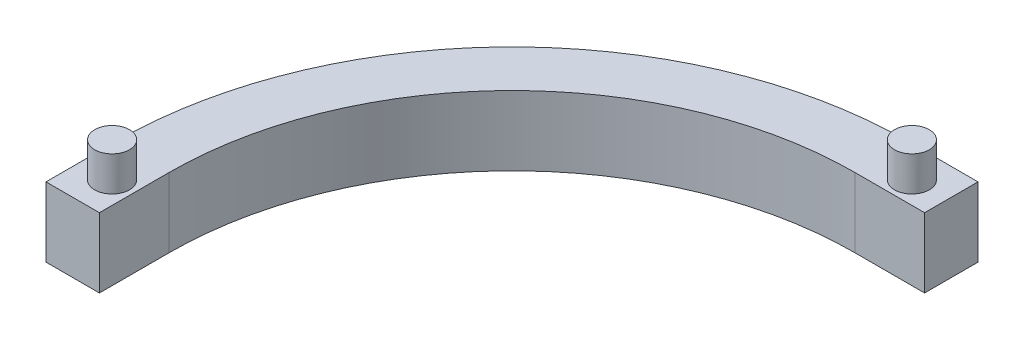
ISO-10303-21;
HEADER;
FILE_DESCRIPTION(('STEP AP214'),'2;1');
FILE_NAME('part.step','',(''),(''),'','','');
FILE_SCHEMA(('AUTOMOTIVE_DESIGN { 1 0 10303 214 1 1 1 1 }'));
ENDSEC;
DATA;
#1=APPLICATION_CONTEXT('core data for automotive mechanical design processes');
#2=APPLICATION_PROTOCOL_DEFINITION('international standard','automotive_design',2000,#1);
#3=PRODUCT_CONTEXT('',#1,'mechanical');
#4=PRODUCT('Part','Part','',(#3));
#5=PRODUCT_RELATED_PRODUCT_CATEGORY('part','',(#4));
#6=PRODUCT_DEFINITION_FORMATION('','',#4);
#7=PRODUCT_DEFINITION_CONTEXT('part definition',#1,'design');
#8=PRODUCT_DEFINITION('design','',#6,#7);
#9=PRODUCT_DEFINITION_SHAPE('','',#8);
#10=(LENGTH_UNIT() NAMED_UNIT(*) SI_UNIT(.MILLI.,.METRE.));
#11=(NAMED_UNIT(*) PLANE_ANGLE_UNIT() SI_UNIT($,.RADIAN.));
#12=(NAMED_UNIT(*) SI_UNIT($,.STERADIAN.) SOLID_ANGLE_UNIT());
#13=UNCERTAINTY_MEASURE_WITH_UNIT(LENGTH_MEASURE(1.E-05),#10,'distance_accuracy_value','');
#14=(GEOMETRIC_REPRESENTATION_CONTEXT(3) GLOBAL_UNCERTAINTY_ASSIGNED_CONTEXT((#13)) GLOBAL_UNIT_ASSIGNED_CONTEXT((#10,
#11,#12)) REPRESENTATION_CONTEXT('',''));
#15=CARTESIAN_POINT('',(0.,0.,0.));
#16=DIRECTION('',(0.,0.,1.));
#17=DIRECTION('',(1.,0.,0.));
#18=AXIS2_PLACEMENT_3D('',#15,#16,#17);
#19=CARTESIAN_POINT('',(0.,-0.00999999999999959,-49.32));
#20=DIRECTION('',(0.,0.,1.));
#21=DIRECTION('',(1.,0.,0.));
#22=AXIS2_PLACEMENT_3D('',#19,#20,#21);
#23=PLANE('',#22);
#24=DIRECTION('',(-1.,0.,0.));
#25=VECTOR('',#24,1.);
#26=CARTESIAN_POINT('',(0.,0.,-49.32));
#27=LINE('',#26,#25);
#28=CARTESIAN_POINT('',(10.,0.,-49.32));
#29=VERTEX_POINT('',#28);
#30=CARTESIAN_POINT('',(0.,0.,-49.32));
#31=VERTEX_POINT('',#30);
#32=EDGE_CURVE('E144',#29,#31,#27,.T.);
#33=ORIENTED_EDGE('',*,*,#32,.F.);
#34=DIRECTION('',(0.,-1.,0.));
#35=VECTOR('',#34,1.);
#36=CARTESIAN_POINT('',(10.,0.,-49.32));
#37=LINE('',#36,#35);
#38=CARTESIAN_POINT('',(10.,10.,-49.32));
#39=VERTEX_POINT('',#38);
#40=EDGE_CURVE('E141',#39,#29,#37,.T.);
#41=ORIENTED_EDGE('',*,*,#40,.F.);
#42=DIRECTION('',(-1.,0.,0.));
#43=VECTOR('',#42,1.);
#44=CARTESIAN_POINT('',(0.,10.,-49.32));
#45=LINE('',#44,#43);
#46=CARTESIAN_POINT('',(0.,10.,-49.32));
#47=VERTEX_POINT('',#46);
#48=EDGE_CURVE('E115',#39,#47,#45,.T.);
#49=ORIENTED_EDGE('',*,*,#48,.T.);
#50=DIRECTION('',(0.,1.,0.));
#51=VECTOR('',#50,1.);
#52=CARTESIAN_POINT('',(0.,-0.00999999999999959,-49.32));
#53=LINE('',#52,#51);
#54=EDGE_CURVE('E11',#31,#47,#53,.T.);
#55=ORIENTED_EDGE('',*,*,#54,.F.);
#56=EDGE_LOOP('',(#33,#41,#49,#55));
#57=FACE_BOUND('',#56,.T.);
#58=ADVANCED_FACE('F33',(#57),#23,.T.);
#59=CARTESIAN_POINT('',(0.,-0.00999999999999959,0.));
#60=DIRECTION('',(0.,1.,0.));
#61=DIRECTION('',(0.,0.,1.));
#62=AXIS2_PLACEMENT_3D('',#59,#60,#61);
#63=CYLINDRICAL_SURFACE('',#62,49.32);
#64=CARTESIAN_POINT('',(0.,0.,0.));
#65=DIRECTION('',(0.,-1.,0.));
#66=DIRECTION('',(0.,0.,-1.));
#67=AXIS2_PLACEMENT_3D('',#64,#65,#66);
#68=CIRCLE('',#67,49.32);
#69=CARTESIAN_POINT('',(-49.32,0.,0.));
#70=VERTEX_POINT('',#69);
#71=EDGE_CURVE('E147',#31,#70,#68,.F.);
#72=ORIENTED_EDGE('',*,*,#71,.F.);
#73=ORIENTED_EDGE('',*,*,#54,.T.);
#74=CARTESIAN_POINT('',(0.,10.,0.));
#75=DIRECTION('',(0.,-1.,0.));
#76=DIRECTION('',(0.,0.,-1.));
#77=AXIS2_PLACEMENT_3D('',#74,#75,#76);
#78=CIRCLE('',#77,49.32);
#79=CARTESIAN_POINT('',(-49.32,10.,0.));
#80=VERTEX_POINT('',#79);
#81=EDGE_CURVE('E154',#47,#80,#78,.F.);
#82=ORIENTED_EDGE('',*,*,#81,.T.);
#83=DIRECTION('',(0.,1.,0.));
#84=VECTOR('',#83,1.);
#85=CARTESIAN_POINT('',(-49.32,-0.00999999999999959,0.));
#86=LINE('',#85,#84);
#87=EDGE_CURVE('E43',#70,#80,#86,.T.);
#88=ORIENTED_EDGE('',*,*,#87,.F.);
#89=EDGE_LOOP('',(#72,#73,#82,#88));
#90=FACE_BOUND('',#89,.T.);
#91=ADVANCED_FACE('F230',(#90),#63,.F.);
#92=CARTESIAN_POINT('',(-49.32,-0.00999999999999959,0.));
#93=DIRECTION('',(1.,0.,0.));
#94=DIRECTION('',(0.,0.,-1.));
#95=AXIS2_PLACEMENT_3D('',#92,#93,#94);
#96=PLANE('',#95);
#97=DIRECTION('',(0.,0.,1.));
#98=VECTOR('',#97,1.);
#99=CARTESIAN_POINT('',(-49.32,0.,0.));
#100=LINE('',#99,#98);
#101=CARTESIAN_POINT('',(-49.32,0.,10.));
#102=VERTEX_POINT('',#101);
#103=EDGE_CURVE('E108',#70,#102,#100,.T.);
#104=ORIENTED_EDGE('',*,*,#103,.F.);
#105=ORIENTED_EDGE('',*,*,#87,.T.);
#106=DIRECTION('',(0.,0.,1.));
#107=VECTOR('',#106,1.);
#108=CARTESIAN_POINT('',(-49.32,10.,0.));
#109=LINE('',#108,#107);
#110=CARTESIAN_POINT('',(-49.32,10.,10.));
#111=VERTEX_POINT('',#110);
#112=EDGE_CURVE('E152',#80,#111,#109,.T.);
#113=ORIENTED_EDGE('',*,*,#112,.T.);
#114=DIRECTION('',(0.,-1.,0.));
#115=VECTOR('',#114,1.);
#116=CARTESIAN_POINT('',(-49.32,10.,10.));
#117=LINE('',#116,#115);
#118=EDGE_CURVE('E150',#111,#102,#117,.T.);
#119=ORIENTED_EDGE('',*,*,#118,.T.);
#120=EDGE_LOOP('',(#104,#105,#113,#119));
#121=FACE_BOUND('',#120,.T.);
#122=ADVANCED_FACE('F174',(#121),#96,.T.);
#123=CARTESIAN_POINT('',(-52.5,6.,5.));
#124=DIRECTION('',(0.,-1.,0.));
#125=DIRECTION('',(0.,0.,-1.));
#126=AXIS2_PLACEMENT_3D('',#123,#124,#125);
#127=PLANE('',#126);
#128=CARTESIAN_POINT('',(-52.5,6.,5.));
#129=DIRECTION('',(0.,-1.,0.));
#130=DIRECTION('',(0.,0.,-1.));
#131=AXIS2_PLACEMENT_3D('',#128,#129,#130);
#132=CIRCLE('',#131,3.);
#133=CARTESIAN_POINT('',(-52.5,6.,2.));
#134=VERTEX_POINT('',#133);
#135=EDGE_CURVE('E194',#134,#134,#132,.T.);
#136=ORIENTED_EDGE('',*,*,#135,.T.);
#137=EDGE_LOOP('',(#136));
#138=FACE_BOUND('',#137,.T.);
#139=ADVANCED_FACE('F216',(#138),#127,.T.);
#140=CARTESIAN_POINT('',(5.,5.,-52.5));
#141=DIRECTION('',(0.,-1.,0.));
#142=DIRECTION('',(0.,0.,-1.));
#143=AXIS2_PLACEMENT_3D('',#140,#141,#142);
#144=PLANE('',#143);
#145=CARTESIAN_POINT('',(5.,5.,-52.5));
#146=DIRECTION('',(0.,-1.,0.));
#147=DIRECTION('',(0.,0.,-1.));
#148=AXIS2_PLACEMENT_3D('',#145,#146,#147);
#149=CIRCLE('',#148,3.);
#150=CARTESIAN_POINT('',(5.,5.,-55.5));
#151=VERTEX_POINT('',#150);
#152=EDGE_CURVE('E133',#151,#151,#149,.T.);
#153=ORIENTED_EDGE('',*,*,#152,.T.);
#154=EDGE_LOOP('',(#153));
#155=FACE_BOUND('',#154,.T.);
#156=ADVANCED_FACE('F218',(#155),#144,.T.);
#157=CARTESIAN_POINT('',(5.,15.,-52.5));
#158=DIRECTION('',(0.,1.,0.));
#159=DIRECTION('',(0.,0.,1.));
#160=AXIS2_PLACEMENT_3D('',#157,#158,#159);
#161=PLANE('',#160);
#162=CARTESIAN_POINT('',(5.,15.,-52.5));
#163=DIRECTION('',(0.,1.,0.));
#164=DIRECTION('',(0.,0.,1.));
#165=AXIS2_PLACEMENT_3D('',#162,#163,#164);
#166=CIRCLE('',#165,2.5);
#167=CARTESIAN_POINT('',(5.,15.,-50.));
#168=VERTEX_POINT('',#167);
#169=EDGE_CURVE('E130',#168,#168,#166,.T.);
#170=ORIENTED_EDGE('',*,*,#169,.T.);
#171=EDGE_LOOP('',(#170));
#172=FACE_BOUND('',#171,.T.);
#173=ADVANCED_FACE('F226',(#172),#161,.T.);
#174=CARTESIAN_POINT('',(-52.5,15.,5.));
#175=DIRECTION('',(0.,1.,0.));
#176=DIRECTION('',(0.,0.,1.));
#177=AXIS2_PLACEMENT_3D('',#174,#175,#176);
#178=PLANE('',#177);
#179=CARTESIAN_POINT('',(-52.5,15.,5.));
#180=DIRECTION('',(0.,1.,0.));
#181=DIRECTION('',(0.,0.,1.));
#182=AXIS2_PLACEMENT_3D('',#179,#180,#181);
#183=CIRCLE('',#182,2.5);
#184=CARTESIAN_POINT('',(-52.5,15.,7.5));
#185=VERTEX_POINT('',#184);
#186=EDGE_CURVE('E190',#185,#185,#183,.T.);
#187=ORIENTED_EDGE('',*,*,#186,.T.);
#188=EDGE_LOOP('',(#187));
#189=FACE_BOUND('',#188,.T.);
#190=ADVANCED_FACE('F238',(#189),#178,.T.);
#191=CARTESIAN_POINT('',(-52.5,6.,5.));
#192=DIRECTION('',(0.,-1.,0.));
#193=DIRECTION('',(0.,0.,-1.));
#194=AXIS2_PLACEMENT_3D('',#191,#192,#193);
#195=CYLINDRICAL_SURFACE('',#194,3.);
#196=ORIENTED_EDGE('',*,*,#135,.F.);
#197=EDGE_LOOP('',(#196));
#198=FACE_BOUND('',#197,.T.);
#199=CARTESIAN_POINT('',(-52.5,0.,5.));
#200=DIRECTION('',(0.,-1.,0.));
#201=DIRECTION('',(0.,0.,-1.));
#202=AXIS2_PLACEMENT_3D('',#199,#200,#201);
#203=CIRCLE('',#202,3.);
#204=CARTESIAN_POINT('',(-52.5,0.,2.));
#205=VERTEX_POINT('',#204);
#206=EDGE_CURVE('E193',#205,#205,#203,.T.);
#207=ORIENTED_EDGE('',*,*,#206,.T.);
#208=EDGE_LOOP('',(#207));
#209=FACE_BOUND('',#208,.T.);
#210=ADVANCED_FACE('F202',(#198,#209),#195,.F.);
#211=CARTESIAN_POINT('',(5.,5.,-52.5));
#212=DIRECTION('',(0.,-1.,0.));
#213=DIRECTION('',(0.,0.,-1.));
#214=AXIS2_PLACEMENT_3D('',#211,#212,#213);
#215=CYLINDRICAL_SURFACE('',#214,3.);
#216=ORIENTED_EDGE('',*,*,#152,.F.);
#217=EDGE_LOOP('',(#216));
#218=FACE_BOUND('',#217,.T.);
#219=CARTESIAN_POINT('',(5.,0.,-52.5));
#220=DIRECTION('',(0.,-1.,0.));
#221=DIRECTION('',(0.,0.,-1.));
#222=AXIS2_PLACEMENT_3D('',#219,#220,#221);
#223=CIRCLE('',#222,3.);
#224=CARTESIAN_POINT('',(5.,0.,-55.5));
#225=VERTEX_POINT('',#224);
#226=EDGE_CURVE('E134',#225,#225,#223,.T.);
#227=ORIENTED_EDGE('',*,*,#226,.T.);
#228=EDGE_LOOP('',(#227));
#229=FACE_BOUND('',#228,.T.);
#230=ADVANCED_FACE('F237',(#218,#229),#215,.F.);
#231=CARTESIAN_POINT('',(-57.,10.,10.));
#232=DIRECTION('',(0.,0.,-1.));
#233=DIRECTION('',(-1.,0.,0.));
#234=AXIS2_PLACEMENT_3D('',#231,#232,#233);
#235=PLANE('',#234);
#236=ORIENTED_EDGE('',*,*,#118,.F.);
#237=DIRECTION('',(1.,0.,0.));
#238=VECTOR('',#237,1.);
#239=CARTESIAN_POINT('',(-57.,10.,10.));
#240=LINE('',#239,#238);
#241=CARTESIAN_POINT('',(-57.,10.,10.));
#242=VERTEX_POINT('',#241);
#243=EDGE_CURVE('E102',#242,#111,#240,.T.);
#244=ORIENTED_EDGE('',*,*,#243,.F.);
#245=DIRECTION('',(0.,-1.,0.));
#246=VECTOR('',#245,1.);
#247=CARTESIAN_POINT('',(-57.,10.,10.));
#248=LINE('',#247,#246);
#249=CARTESIAN_POINT('',(-57.,0.,10.));
#250=VERTEX_POINT('',#249);
#251=EDGE_CURVE('E87',#242,#250,#248,.T.);
#252=ORIENTED_EDGE('',*,*,#251,.T.);
#253=DIRECTION('',(1.,0.,0.));
#254=VECTOR('',#253,1.);
#255=CARTESIAN_POINT('',(-57.,0.,10.));
#256=LINE('',#255,#254);
#257=EDGE_CURVE('E94',#250,#102,#256,.T.);
#258=ORIENTED_EDGE('',*,*,#257,.T.);
#259=EDGE_LOOP('',(#236,#244,#252,#258));
#260=FACE_BOUND('',#259,.T.);
#261=ADVANCED_FACE('F100',(#260),#235,.F.);
#262=CARTESIAN_POINT('',(-57.,10.,0.));
#263=DIRECTION('',(1.,0.,0.));
#264=DIRECTION('',(0.,0.,-1.));
#265=AXIS2_PLACEMENT_3D('',#262,#263,#264);
#266=PLANE('',#265);
#267=DIRECTION('',(0.,0.,1.));
#268=VECTOR('',#267,1.);
#269=CARTESIAN_POINT('',(-57.,0.,0.));
#270=LINE('',#269,#268);
#271=CARTESIAN_POINT('',(-57.,0.,0.));
#272=VERTEX_POINT('',#271);
#273=EDGE_CURVE('E84',#272,#250,#270,.T.);
#274=ORIENTED_EDGE('',*,*,#273,.T.);
#275=ORIENTED_EDGE('',*,*,#251,.F.);
#276=DIRECTION('',(0.,0.,1.));
#277=VECTOR('',#276,1.);
#278=CARTESIAN_POINT('',(-57.,10.,0.));
#279=LINE('',#278,#277);
#280=CARTESIAN_POINT('',(-57.,10.,0.));
#281=VERTEX_POINT('',#280);
#282=EDGE_CURVE('E71',#281,#242,#279,.T.);
#283=ORIENTED_EDGE('',*,*,#282,.F.);
#284=DIRECTION('',(0.,-1.,0.));
#285=VECTOR('',#284,1.);
#286=CARTESIAN_POINT('',(-57.,10.,0.));
#287=LINE('',#286,#285);
#288=EDGE_CURVE('E90',#281,#272,#287,.T.);
#289=ORIENTED_EDGE('',*,*,#288,.T.);
#290=EDGE_LOOP('',(#274,#275,#283,#289));
#291=FACE_BOUND('',#290,.T.);
#292=ADVANCED_FACE('F86',(#291),#266,.F.);
#293=CARTESIAN_POINT('',(0.,10.,0.));
#294=DIRECTION('',(0.,-1.,0.));
#295=DIRECTION('',(0.,0.,-1.));
#296=AXIS2_PLACEMENT_3D('',#293,#294,#295);
#297=CYLINDRICAL_SURFACE('',#296,57.);
#298=DIRECTION('',(0.,-1.,0.));
#299=VECTOR('',#298,1.);
#300=CARTESIAN_POINT('',(0.,10.,-57.));
#301=LINE('',#300,#299);
#302=CARTESIAN_POINT('',(0.,0.,-57.));
#303=VERTEX_POINT('',#302);
#304=CARTESIAN_POINT('',(0.,10.,-57.));
#305=VERTEX_POINT('',#304);
#306=EDGE_CURVE('E126',#303,#305,#301,.F.);
#307=ORIENTED_EDGE('',*,*,#306,.F.);
#308=CARTESIAN_POINT('',(0.,0.,0.));
#309=DIRECTION('',(0.,1.,0.));
#310=DIRECTION('',(0.,0.,-1.));
#311=AXIS2_PLACEMENT_3D('',#308,#309,#310);
#312=CIRCLE('',#311,57.);
#313=EDGE_CURVE('E95',#303,#272,#312,.T.);
#314=ORIENTED_EDGE('',*,*,#313,.T.);
#315=ORIENTED_EDGE('',*,*,#288,.F.);
#316=CARTESIAN_POINT('',(0.,10.,0.));
#317=DIRECTION('',(0.,1.,0.));
#318=DIRECTION('',(0.,0.,-1.));
#319=AXIS2_PLACEMENT_3D('',#316,#317,#318);
#320=CIRCLE('',#319,57.);
#321=EDGE_CURVE('E110',#305,#281,#320,.T.);
#322=ORIENTED_EDGE('',*,*,#321,.F.);
#323=EDGE_LOOP('',(#307,#314,#315,#322));
#324=FACE_BOUND('',#323,.T.);
#325=ADVANCED_FACE('F241',(#324),#297,.T.);
#326=CARTESIAN_POINT('',(5.,15.,-52.5));
#327=DIRECTION('',(0.,-1.,0.));
#328=DIRECTION('',(0.,0.,-1.));
#329=AXIS2_PLACEMENT_3D('',#326,#327,#328);
#330=CYLINDRICAL_SURFACE('',#329,2.5);
#331=ORIENTED_EDGE('',*,*,#169,.F.);
#332=EDGE_LOOP('',(#331));
#333=FACE_BOUND('',#332,.T.);
#334=CARTESIAN_POINT('',(5.,10.,-52.5));
#335=DIRECTION('',(0.,-1.,0.));
#336=DIRECTION('',(0.,0.,-1.));
#337=AXIS2_PLACEMENT_3D('',#334,#335,#336);
#338=CIRCLE('',#337,2.5);
#339=CARTESIAN_POINT('',(5.,10.,-55.));
#340=VERTEX_POINT('',#339);
#341=EDGE_CURVE('E143',#340,#340,#338,.F.);
#342=ORIENTED_EDGE('',*,*,#341,.T.);
#343=EDGE_LOOP('',(#342));
#344=FACE_BOUND('',#343,.T.);
#345=ADVANCED_FACE('F243',(#333,#344),#330,.T.);
#346=CARTESIAN_POINT('',(-52.5,15.,5.));
#347=DIRECTION('',(0.,-1.,0.));
#348=DIRECTION('',(0.,0.,-1.));
#349=AXIS2_PLACEMENT_3D('',#346,#347,#348);
#350=CYLINDRICAL_SURFACE('',#349,2.5);
#351=ORIENTED_EDGE('',*,*,#186,.F.);
#352=EDGE_LOOP('',(#351));
#353=FACE_BOUND('',#352,.T.);
#354=CARTESIAN_POINT('',(-52.5,10.,5.));
#355=DIRECTION('',(0.,-1.,0.));
#356=DIRECTION('',(0.,0.,-1.));
#357=AXIS2_PLACEMENT_3D('',#354,#355,#356);
#358=CIRCLE('',#357,2.5);
#359=CARTESIAN_POINT('',(-52.5,10.,2.5));
#360=VERTEX_POINT('',#359);
#361=EDGE_CURVE('E185',#360,#360,#358,.F.);
#362=ORIENTED_EDGE('',*,*,#361,.T.);
#363=EDGE_LOOP('',(#362));
#364=FACE_BOUND('',#363,.T.);
#365=ADVANCED_FACE('F212',(#353,#364),#350,.T.);
#366=CARTESIAN_POINT('',(10.,10.,-57.));
#367=DIRECTION('',(0.,0.,1.));
#368=DIRECTION('',(1.,0.,0.));
#369=AXIS2_PLACEMENT_3D('',#366,#367,#368);
#370=PLANE('',#369);
#371=ORIENTED_EDGE('',*,*,#306,.T.);
#372=DIRECTION('',(-1.,0.,0.));
#373=VECTOR('',#372,1.);
#374=CARTESIAN_POINT('',(10.,10.,-57.));
#375=LINE('',#374,#373);
#376=CARTESIAN_POINT('',(10.,10.,-57.));
#377=VERTEX_POINT('',#376);
#378=EDGE_CURVE('E118',#377,#305,#375,.T.);
#379=ORIENTED_EDGE('',*,*,#378,.F.);
#380=DIRECTION('',(0.,1.,0.));
#381=VECTOR('',#380,1.);
#382=CARTESIAN_POINT('',(10.,10.,-57.));
#383=LINE('',#382,#381);
#384=CARTESIAN_POINT('',(10.,0.,-57.));
#385=VERTEX_POINT('',#384);
#386=EDGE_CURVE('E62',#385,#377,#383,.T.);
#387=ORIENTED_EDGE('',*,*,#386,.F.);
#388=DIRECTION('',(-1.,0.,0.));
#389=VECTOR('',#388,1.);
#390=CARTESIAN_POINT('',(10.,0.,-57.));
#391=LINE('',#390,#389);
#392=EDGE_CURVE('E52',#385,#303,#391,.T.);
#393=ORIENTED_EDGE('',*,*,#392,.T.);
#394=EDGE_LOOP('',(#371,#379,#387,#393));
#395=FACE_BOUND('',#394,.T.);
#396=ADVANCED_FACE('F183',(#395),#370,.F.);
#397=CARTESIAN_POINT('',(0.,0.,0.));
#398=DIRECTION('',(0.,-1.,0.));
#399=DIRECTION('',(0.,0.,-1.));
#400=AXIS2_PLACEMENT_3D('',#397,#398,#399);
#401=PLANE('',#400);
#402=ORIENTED_EDGE('',*,*,#226,.F.);
#403=EDGE_LOOP('',(#402));
#404=FACE_BOUND('',#403,.T.);
#405=ORIENTED_EDGE('',*,*,#206,.F.);
#406=EDGE_LOOP('',(#405));
#407=FACE_BOUND('',#406,.T.);
#408=ORIENTED_EDGE('',*,*,#71,.T.);
#409=ORIENTED_EDGE('',*,*,#103,.T.);
#410=ORIENTED_EDGE('',*,*,#257,.F.);
#411=ORIENTED_EDGE('',*,*,#273,.F.);
#412=ORIENTED_EDGE('',*,*,#313,.F.);
#413=ORIENTED_EDGE('',*,*,#392,.F.);
#414=DIRECTION('',(0.,0.,-1.));
#415=VECTOR('',#414,1.);
#416=CARTESIAN_POINT('',(10.,0.,-47.5));
#417=LINE('',#416,#415);
#418=EDGE_CURVE('E37',#29,#385,#417,.T.);
#419=ORIENTED_EDGE('',*,*,#418,.F.);
#420=ORIENTED_EDGE('',*,*,#32,.T.);
#421=EDGE_LOOP('',(#408,#409,#410,#411,#412,#413,#419,#420));
#422=FACE_BOUND('',#421,.T.);
#423=ADVANCED_FACE('F106',(#404,#407,#422),#401,.T.);
#424=CARTESIAN_POINT('',(0.,10.,0.));
#425=DIRECTION('',(0.,-1.,0.));
#426=DIRECTION('',(0.,0.,-1.));
#427=AXIS2_PLACEMENT_3D('',#424,#425,#426);
#428=PLANE('',#427);
#429=ORIENTED_EDGE('',*,*,#361,.F.);
#430=EDGE_LOOP('',(#429));
#431=FACE_BOUND('',#430,.T.);
#432=ORIENTED_EDGE('',*,*,#341,.F.);
#433=EDGE_LOOP('',(#432));
#434=FACE_BOUND('',#433,.T.);
#435=ORIENTED_EDGE('',*,*,#112,.F.);
#436=ORIENTED_EDGE('',*,*,#81,.F.);
#437=ORIENTED_EDGE('',*,*,#48,.F.);
#438=DIRECTION('',(0.,0.,1.));
#439=VECTOR('',#438,1.);
#440=CARTESIAN_POINT('',(10.,10.,-47.5));
#441=LINE('',#440,#439);
#442=EDGE_CURVE('E117',#377,#39,#441,.T.);
#443=ORIENTED_EDGE('',*,*,#442,.F.);
#444=ORIENTED_EDGE('',*,*,#378,.T.);
#445=ORIENTED_EDGE('',*,*,#321,.T.);
#446=ORIENTED_EDGE('',*,*,#282,.T.);
#447=ORIENTED_EDGE('',*,*,#243,.T.);
#448=EDGE_LOOP('',(#435,#436,#437,#443,#444,#445,#446,#447));
#449=FACE_BOUND('',#448,.T.);
#450=ADVANCED_FACE('F170',(#431,#434,#449),#428,.F.);
#451=CARTESIAN_POINT('',(10.,0.,0.));
#452=DIRECTION('',(1.,0.,0.));
#453=DIRECTION('',(0.,0.,-1.));
#454=AXIS2_PLACEMENT_3D('',#451,#452,#453);
#455=PLANE('',#454);
#456=ORIENTED_EDGE('',*,*,#442,.T.);
#457=ORIENTED_EDGE('',*,*,#40,.T.);
#458=ORIENTED_EDGE('',*,*,#418,.T.);
#459=ORIENTED_EDGE('',*,*,#386,.T.);
#460=EDGE_LOOP('',(#456,#457,#458,#459));
#461=FACE_BOUND('',#460,.T.);
#462=ADVANCED_FACE('F35',(#461),#455,.T.);
#463=CLOSED_SHELL('',(#58,#91,#122,#139,#156,#173,#190,#210,#230,#261,#292,#325,#345,#365,#396,
#423,#450,#462));
#464=MANIFOLD_SOLID_BREP('B2',#463);
#465=ADVANCED_BREP_SHAPE_REPRESENTATION('',(#18,#464),#14);
#466=SHAPE_DEFINITION_REPRESENTATION(#9,#465);
ENDSEC;
END-ISO-10303-21;
